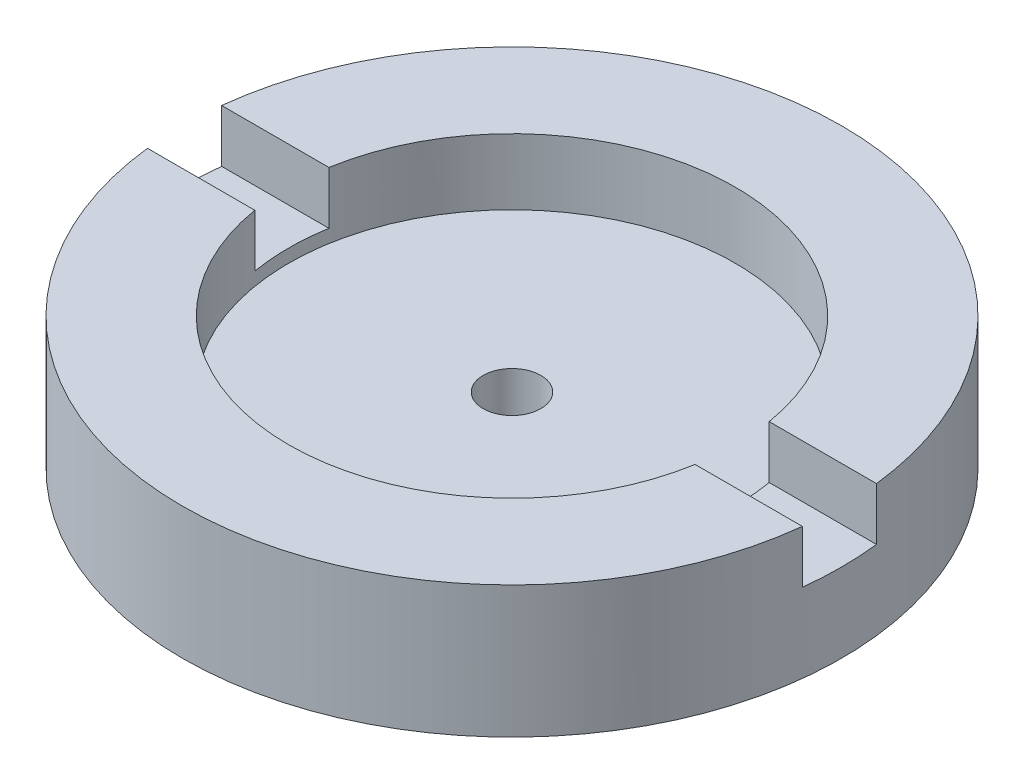
ISO-10303-21;
HEADER;
FILE_DESCRIPTION(('STEP AP214'),'2;1');
FILE_NAME('part.step','',(''),(''),'','','');
FILE_SCHEMA(('AUTOMOTIVE_DESIGN { 1 0 10303 214 1 1 1 1 }'));
ENDSEC;
DATA;
#1=APPLICATION_CONTEXT('core data for automotive mechanical design processes');
#2=APPLICATION_PROTOCOL_DEFINITION('international standard','automotive_design',2000,#1);
#3=PRODUCT_CONTEXT('',#1,'mechanical');
#4=PRODUCT('Part','Part','',(#3));
#5=PRODUCT_RELATED_PRODUCT_CATEGORY('part','',(#4));
#6=PRODUCT_DEFINITION_FORMATION('','',#4);
#7=PRODUCT_DEFINITION_CONTEXT('part definition',#1,'design');
#8=PRODUCT_DEFINITION('design','',#6,#7);
#9=PRODUCT_DEFINITION_SHAPE('','',#8);
#10=(LENGTH_UNIT() NAMED_UNIT(*) SI_UNIT(.MILLI.,.METRE.));
#11=(NAMED_UNIT(*) PLANE_ANGLE_UNIT() SI_UNIT($,.RADIAN.));
#12=(NAMED_UNIT(*) SI_UNIT($,.STERADIAN.) SOLID_ANGLE_UNIT());
#13=UNCERTAINTY_MEASURE_WITH_UNIT(LENGTH_MEASURE(1.E-05),#10,'distance_accuracy_value','');
#14=(GEOMETRIC_REPRESENTATION_CONTEXT(3) GLOBAL_UNCERTAINTY_ASSIGNED_CONTEXT((#13)) GLOBAL_UNIT_ASSIGNED_CONTEXT((#10,
#11,#12)) REPRESENTATION_CONTEXT('',''));
#15=CARTESIAN_POINT('',(0.,0.,0.));
#16=DIRECTION('',(0.,0.,1.));
#17=DIRECTION('',(1.,0.,0.));
#18=AXIS2_PLACEMENT_3D('',#15,#16,#17);
#19=CARTESIAN_POINT('',(0.,8.,0.));
#20=DIRECTION('',(0.,1.,0.));
#21=DIRECTION('',(0.,0.,1.));
#22=AXIS2_PLACEMENT_3D('',#19,#20,#21);
#23=PLANE('',#22);
#24=DIRECTION('',(-1.,0.,0.));
#25=VECTOR('',#24,1.);
#26=CARTESIAN_POINT('',(28.0656431380181,8.,-2.25));
#27=LINE('',#26,#25);
#28=CARTESIAN_POINT('',(19.8730344940072,8.,-2.25));
#29=VERTEX_POINT('',#28);
#30=CARTESIAN_POINT('',(13.3618860944105,8.,-2.25));
#31=VERTEX_POINT('',#30);
#32=EDGE_CURVE('E172',#29,#31,#27,.T.);
#33=ORIENTED_EDGE('',*,*,#32,.F.);
#34=CARTESIAN_POINT('',(0.,8.,0.));
#35=DIRECTION('',(0.,1.,0.));
#36=DIRECTION('',(0.,0.,1.));
#37=AXIS2_PLACEMENT_3D('',#34,#35,#36);
#38=CIRCLE('',#37,20.);
#39=CARTESIAN_POINT('',(-19.8730344940072,8.,-2.25));
#40=VERTEX_POINT('',#39);
#41=EDGE_CURVE('E124',#29,#40,#38,.T.);
#42=ORIENTED_EDGE('',*,*,#41,.T.);
#43=CARTESIAN_POINT('',(-13.3618860944105,8.,-2.25));
#44=VERTEX_POINT('',#43);
#45=EDGE_CURVE('E117',#44,#40,#27,.T.);
#46=ORIENTED_EDGE('',*,*,#45,.F.);
#47=CARTESIAN_POINT('',(0.,8.,0.));
#48=DIRECTION('',(0.,1.,0.));
#49=DIRECTION('',(0.,0.,1.));
#50=AXIS2_PLACEMENT_3D('',#47,#48,#49);
#51=CIRCLE('',#50,13.55);
#52=EDGE_CURVE('E158',#31,#44,#51,.T.);
#53=ORIENTED_EDGE('',*,*,#52,.F.);
#54=EDGE_LOOP('',(#33,#42,#46,#53));
#55=FACE_BOUND('',#54,.T.);
#56=ADVANCED_FACE('F33',(#55),#23,.T.);
#57=CARTESIAN_POINT('',(0.,8.,0.));
#58=DIRECTION('',(0.,-1.,0.));
#59=DIRECTION('',(0.,0.,-1.));
#60=AXIS2_PLACEMENT_3D('',#57,#58,#59);
#61=CYLINDRICAL_SURFACE('',#60,20.);
#62=ORIENTED_EDGE('',*,*,#41,.F.);
#63=DIRECTION('',(0.,-1.,0.));
#64=VECTOR('',#63,1.);
#65=CARTESIAN_POINT('',(19.8730344940072,8.,-2.25));
#66=LINE('',#65,#64);
#67=CARTESIAN_POINT('',(19.8730344940072,4.8,-2.25));
#68=VERTEX_POINT('',#67);
#69=EDGE_CURVE('E163',#29,#68,#66,.T.);
#70=ORIENTED_EDGE('',*,*,#69,.T.);
#71=CARTESIAN_POINT('',(0.,4.8,0.));
#72=DIRECTION('',(0.,1.,0.));
#73=DIRECTION('',(0.,0.,1.));
#74=AXIS2_PLACEMENT_3D('',#71,#72,#73);
#75=CIRCLE('',#74,20.);
#76=CARTESIAN_POINT('',(19.8730344940072,4.8,2.25));
#77=VERTEX_POINT('',#76);
#78=EDGE_CURVE('E169',#77,#68,#75,.T.);
#79=ORIENTED_EDGE('',*,*,#78,.F.);
#80=DIRECTION('',(0.,-1.,0.));
#81=VECTOR('',#80,1.);
#82=CARTESIAN_POINT('',(19.8730344940072,8.,2.25));
#83=LINE('',#82,#81);
#84=CARTESIAN_POINT('',(19.8730344940072,8.,2.25));
#85=VERTEX_POINT('',#84);
#86=EDGE_CURVE('E107',#77,#85,#83,.F.);
#87=ORIENTED_EDGE('',*,*,#86,.T.);
#88=CARTESIAN_POINT('',(-19.8730344940072,8.,2.25));
#89=VERTEX_POINT('',#88);
#90=EDGE_CURVE('E114',#89,#85,#38,.T.);
#91=ORIENTED_EDGE('',*,*,#90,.F.);
#92=DIRECTION('',(0.,-1.,0.));
#93=VECTOR('',#92,1.);
#94=CARTESIAN_POINT('',(-19.8730344940072,8.,2.25));
#95=LINE('',#94,#93);
#96=CARTESIAN_POINT('',(-19.8730344940072,4.8,2.25));
#97=VERTEX_POINT('',#96);
#98=EDGE_CURVE('E98',#89,#97,#95,.T.);
#99=ORIENTED_EDGE('',*,*,#98,.T.);
#100=CARTESIAN_POINT('',(-19.8730344940072,4.8,-2.25));
#101=VERTEX_POINT('',#100);
#102=EDGE_CURVE('E170',#101,#97,#75,.T.);
#103=ORIENTED_EDGE('',*,*,#102,.F.);
#104=DIRECTION('',(0.,-1.,0.));
#105=VECTOR('',#104,1.);
#106=CARTESIAN_POINT('',(-19.8730344940072,8.,-2.25));
#107=LINE('',#106,#105);
#108=EDGE_CURVE('E106',#101,#40,#107,.F.);
#109=ORIENTED_EDGE('',*,*,#108,.T.);
#110=EDGE_LOOP('',(#62,#70,#79,#87,#91,#99,#103,#109));
#111=FACE_BOUND('',#110,.T.);
#112=CARTESIAN_POINT('',(0.,0.,0.));
#113=DIRECTION('',(0.,1.,0.));
#114=DIRECTION('',(0.,0.,1.));
#115=AXIS2_PLACEMENT_3D('',#112,#113,#114);
#116=CIRCLE('',#115,20.);
#117=CARTESIAN_POINT('',(0.,0.,20.));
#118=VERTEX_POINT('',#117);
#119=EDGE_CURVE('E125',#118,#118,#116,.T.);
#120=ORIENTED_EDGE('',*,*,#119,.T.);
#121=EDGE_LOOP('',(#120));
#122=FACE_BOUND('',#121,.T.);
#123=ADVANCED_FACE('F35',(#111,#122),#61,.T.);
#124=DIRECTION('',(1.,0.,0.));
#125=VECTOR('',#124,1.);
#126=CARTESIAN_POINT('',(28.0656431380181,8.,2.25));
#127=LINE('',#126,#125);
#128=CARTESIAN_POINT('',(-13.3618860944105,8.,2.25));
#129=VERTEX_POINT('',#128);
#130=EDGE_CURVE('E101',#89,#129,#127,.T.);
#131=ORIENTED_EDGE('',*,*,#130,.F.);
#132=ORIENTED_EDGE('',*,*,#90,.T.);
#133=CARTESIAN_POINT('',(13.3618860944105,8.,2.25));
#134=VERTEX_POINT('',#133);
#135=EDGE_CURVE('E118',#134,#85,#127,.T.);
#136=ORIENTED_EDGE('',*,*,#135,.F.);
#137=EDGE_CURVE('E116',#129,#134,#51,.T.);
#138=ORIENTED_EDGE('',*,*,#137,.F.);
#139=EDGE_LOOP('',(#131,#132,#136,#138));
#140=FACE_BOUND('',#139,.T.);
#141=ADVANCED_FACE('F112',(#140),#23,.T.);
#142=CARTESIAN_POINT('',(0.,0.,0.));
#143=DIRECTION('',(0.,1.,0.));
#144=DIRECTION('',(0.,0.,1.));
#145=AXIS2_PLACEMENT_3D('',#142,#143,#144);
#146=PLANE('',#145);
#147=CARTESIAN_POINT('',(0.,0.,0.));
#148=DIRECTION('',(0.,-1.,0.));
#149=DIRECTION('',(0.,0.,-1.));
#150=AXIS2_PLACEMENT_3D('',#147,#148,#149);
#151=CIRCLE('',#150,1.75);
#152=CARTESIAN_POINT('',(0.,0.,-1.75));
#153=VERTEX_POINT('',#152);
#154=EDGE_CURVE('E177',#153,#153,#151,.T.);
#155=ORIENTED_EDGE('',*,*,#154,.F.);
#156=EDGE_LOOP('',(#155));
#157=FACE_BOUND('',#156,.T.);
#158=ORIENTED_EDGE('',*,*,#119,.F.);
#159=EDGE_LOOP('',(#158));
#160=FACE_BOUND('',#159,.T.);
#161=ADVANCED_FACE('F193',(#157,#160),#146,.F.);
#162=CARTESIAN_POINT('',(0.,4.,0.));
#163=DIRECTION('',(0.,1.,0.));
#164=DIRECTION('',(0.,0.,1.));
#165=AXIS2_PLACEMENT_3D('',#162,#163,#164);
#166=CYLINDRICAL_SURFACE('',#165,13.55);
#167=ORIENTED_EDGE('',*,*,#52,.T.);
#168=DIRECTION('',(0.,1.,0.));
#169=VECTOR('',#168,1.);
#170=CARTESIAN_POINT('',(-13.3618860944105,4.,-2.25));
#171=LINE('',#170,#169);
#172=CARTESIAN_POINT('',(-13.3618860944105,4.8,-2.25));
#173=VERTEX_POINT('',#172);
#174=EDGE_CURVE('E11',#44,#173,#171,.F.);
#175=ORIENTED_EDGE('',*,*,#174,.T.);
#176=CARTESIAN_POINT('',(0.,4.8,0.));
#177=DIRECTION('',(0.,1.,0.));
#178=DIRECTION('',(0.,0.,1.));
#179=AXIS2_PLACEMENT_3D('',#176,#177,#178);
#180=CIRCLE('',#179,13.55);
#181=CARTESIAN_POINT('',(-13.3618860944105,4.8,2.25));
#182=VERTEX_POINT('',#181);
#183=EDGE_CURVE('E137',#182,#173,#180,.F.);
#184=ORIENTED_EDGE('',*,*,#183,.F.);
#185=DIRECTION('',(0.,1.,0.));
#186=VECTOR('',#185,1.);
#187=CARTESIAN_POINT('',(-13.3618860944105,4.,2.25));
#188=LINE('',#187,#186);
#189=EDGE_CURVE('E42',#182,#129,#188,.T.);
#190=ORIENTED_EDGE('',*,*,#189,.T.);
#191=ORIENTED_EDGE('',*,*,#137,.T.);
#192=DIRECTION('',(0.,1.,0.));
#193=VECTOR('',#192,1.);
#194=CARTESIAN_POINT('',(13.3618860944105,4.,2.25));
#195=LINE('',#194,#193);
#196=CARTESIAN_POINT('',(13.3618860944105,4.8,2.25));
#197=VERTEX_POINT('',#196);
#198=EDGE_CURVE('E136',#134,#197,#195,.F.);
#199=ORIENTED_EDGE('',*,*,#198,.T.);
#200=CARTESIAN_POINT('',(13.3618860944105,4.8,-2.25));
#201=VERTEX_POINT('',#200);
#202=EDGE_CURVE('E128',#201,#197,#180,.F.);
#203=ORIENTED_EDGE('',*,*,#202,.F.);
#204=DIRECTION('',(0.,1.,0.));
#205=VECTOR('',#204,1.);
#206=CARTESIAN_POINT('',(13.3618860944105,4.,-2.25));
#207=LINE('',#206,#205);
#208=EDGE_CURVE('E140',#201,#31,#207,.T.);
#209=ORIENTED_EDGE('',*,*,#208,.T.);
#210=EDGE_LOOP('',(#167,#175,#184,#190,#191,#199,#203,#209));
#211=FACE_BOUND('',#210,.T.);
#212=CARTESIAN_POINT('',(0.,4.,0.));
#213=DIRECTION('',(0.,1.,0.));
#214=DIRECTION('',(0.,0.,1.));
#215=AXIS2_PLACEMENT_3D('',#212,#213,#214);
#216=CIRCLE('',#215,13.55);
#217=CARTESIAN_POINT('',(0.,4.,13.55));
#218=VERTEX_POINT('',#217);
#219=EDGE_CURVE('E130',#218,#218,#216,.T.);
#220=ORIENTED_EDGE('',*,*,#219,.F.);
#221=EDGE_LOOP('',(#220));
#222=FACE_BOUND('',#221,.T.);
#223=ADVANCED_FACE('F155',(#211,#222),#166,.F.);
#224=CARTESIAN_POINT('',(0.,4.,0.));
#225=DIRECTION('',(0.,1.,0.));
#226=DIRECTION('',(0.,0.,1.));
#227=AXIS2_PLACEMENT_3D('',#224,#225,#226);
#228=PLANE('',#227);
#229=CARTESIAN_POINT('',(0.,4.,0.));
#230=DIRECTION('',(0.,1.,0.));
#231=DIRECTION('',(0.,0.,1.));
#232=AXIS2_PLACEMENT_3D('',#229,#230,#231);
#233=CIRCLE('',#232,1.75);
#234=CARTESIAN_POINT('',(0.,4.,1.75));
#235=VERTEX_POINT('',#234);
#236=EDGE_CURVE('E37',#235,#235,#233,.T.);
#237=ORIENTED_EDGE('',*,*,#236,.F.);
#238=EDGE_LOOP('',(#237));
#239=FACE_BOUND('',#238,.T.);
#240=ORIENTED_EDGE('',*,*,#219,.T.);
#241=EDGE_LOOP('',(#240));
#242=FACE_BOUND('',#241,.T.);
#243=ADVANCED_FACE('F186',(#239,#242),#228,.T.);
#244=CARTESIAN_POINT('',(0.,4.8,0.));
#245=DIRECTION('',(0.,1.,0.));
#246=DIRECTION('',(0.,0.,1.));
#247=AXIS2_PLACEMENT_3D('',#244,#245,#246);
#248=PLANE('',#247);
#249=ORIENTED_EDGE('',*,*,#78,.T.);
#250=DIRECTION('',(-1.,0.,0.));
#251=VECTOR('',#250,1.);
#252=CARTESIAN_POINT('',(28.0656431380181,4.8,-2.25));
#253=LINE('',#252,#251);
#254=EDGE_CURVE('E57',#68,#201,#253,.T.);
#255=ORIENTED_EDGE('',*,*,#254,.T.);
#256=ORIENTED_EDGE('',*,*,#202,.T.);
#257=DIRECTION('',(1.,0.,0.));
#258=VECTOR('',#257,1.);
#259=CARTESIAN_POINT('',(28.0656431380181,4.8,2.25));
#260=LINE('',#259,#258);
#261=EDGE_CURVE('E174',#197,#77,#260,.T.);
#262=ORIENTED_EDGE('',*,*,#261,.T.);
#263=EDGE_LOOP('',(#249,#255,#256,#262));
#264=FACE_BOUND('',#263,.T.);
#265=ADVANCED_FACE('F189',(#264),#248,.T.);
#266=CARTESIAN_POINT('',(28.0656431380181,4.8,2.25));
#267=DIRECTION('',(0.,0.,1.));
#268=DIRECTION('',(1.,0.,0.));
#269=AXIS2_PLACEMENT_3D('',#266,#267,#268);
#270=PLANE('',#269);
#271=ORIENTED_EDGE('',*,*,#261,.F.);
#272=ORIENTED_EDGE('',*,*,#198,.F.);
#273=ORIENTED_EDGE('',*,*,#135,.T.);
#274=ORIENTED_EDGE('',*,*,#86,.F.);
#275=EDGE_LOOP('',(#271,#272,#273,#274));
#276=FACE_BOUND('',#275,.T.);
#277=ADVANCED_FACE('F242',(#276),#270,.F.);
#278=CARTESIAN_POINT('',(28.0656431380181,4.8,-2.25));
#279=DIRECTION('',(0.,0.,-1.));
#280=DIRECTION('',(-1.,0.,0.));
#281=AXIS2_PLACEMENT_3D('',#278,#279,#280);
#282=PLANE('',#281);
#283=ORIENTED_EDGE('',*,*,#32,.T.);
#284=ORIENTED_EDGE('',*,*,#208,.F.);
#285=ORIENTED_EDGE('',*,*,#254,.F.);
#286=ORIENTED_EDGE('',*,*,#69,.F.);
#287=EDGE_LOOP('',(#283,#284,#285,#286));
#288=FACE_BOUND('',#287,.T.);
#289=ADVANCED_FACE('F248',(#288),#282,.F.);
#290=EDGE_CURVE('E148',#173,#101,#253,.T.);
#291=ORIENTED_EDGE('',*,*,#290,.F.);
#292=ORIENTED_EDGE('',*,*,#174,.F.);
#293=ORIENTED_EDGE('',*,*,#45,.T.);
#294=ORIENTED_EDGE('',*,*,#108,.F.);
#295=EDGE_LOOP('',(#291,#292,#293,#294));
#296=FACE_BOUND('',#295,.T.);
#297=ADVANCED_FACE('F150',(#296),#282,.F.);
#298=ORIENTED_EDGE('',*,*,#130,.T.);
#299=ORIENTED_EDGE('',*,*,#189,.F.);
#300=EDGE_CURVE('E49',#97,#182,#260,.T.);
#301=ORIENTED_EDGE('',*,*,#300,.F.);
#302=ORIENTED_EDGE('',*,*,#98,.F.);
#303=EDGE_LOOP('',(#298,#299,#301,#302));
#304=FACE_BOUND('',#303,.T.);
#305=ADVANCED_FACE('F100',(#304),#270,.F.);
#306=ORIENTED_EDGE('',*,*,#102,.T.);
#307=ORIENTED_EDGE('',*,*,#300,.T.);
#308=ORIENTED_EDGE('',*,*,#183,.T.);
#309=ORIENTED_EDGE('',*,*,#290,.T.);
#310=EDGE_LOOP('',(#306,#307,#308,#309));
#311=FACE_BOUND('',#310,.T.);
#312=ADVANCED_FACE('F147',(#311),#248,.T.);
#313=CARTESIAN_POINT('',(0.,8.,0.));
#314=DIRECTION('',(0.,-1.,0.));
#315=DIRECTION('',(0.,0.,-1.));
#316=AXIS2_PLACEMENT_3D('',#313,#314,#315);
#317=CYLINDRICAL_SURFACE('',#316,1.75);
#318=ORIENTED_EDGE('',*,*,#236,.T.);
#319=EDGE_LOOP('',(#318));
#320=FACE_BOUND('',#319,.T.);
#321=ORIENTED_EDGE('',*,*,#154,.T.);
#322=EDGE_LOOP('',(#321));
#323=FACE_BOUND('',#322,.T.);
#324=ADVANCED_FACE('F184',(#320,#323),#317,.F.);
#325=CLOSED_SHELL('',(#56,#123,#141,#161,#223,#243,#265,#277,#289,#297,#305,#312,#324));
#326=MANIFOLD_SOLID_BREP('B2',#325);
#327=ADVANCED_BREP_SHAPE_REPRESENTATION('',(#18,#326),#14);
#328=SHAPE_DEFINITION_REPRESENTATION(#9,#327);
ENDSEC;
END-ISO-10303-21;
